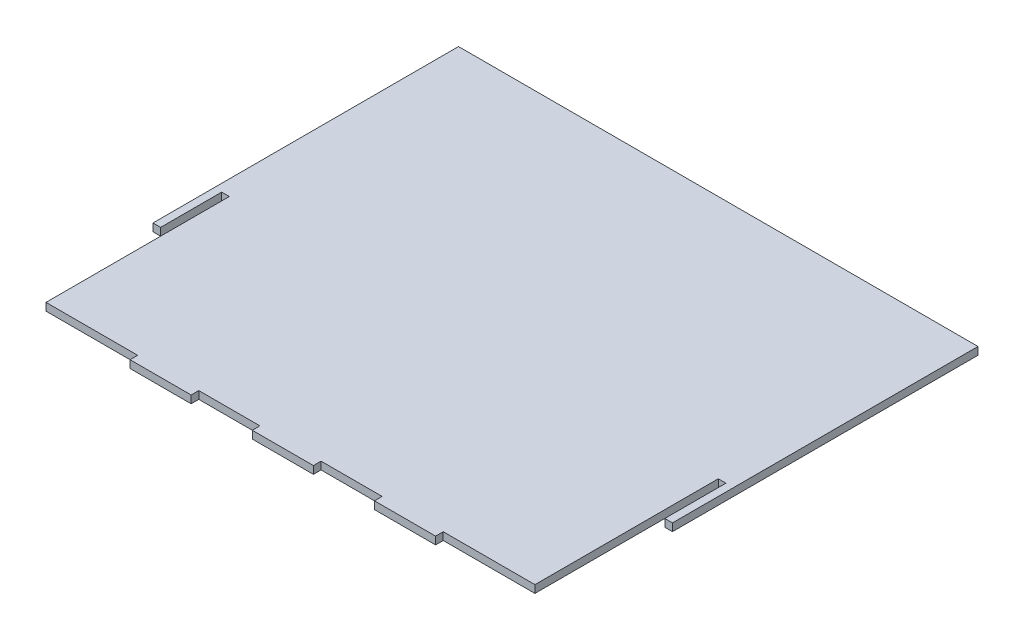
ISO-10303-21;
HEADER;
FILE_DESCRIPTION(('STEP AP214'),'2;1');
FILE_NAME('part.step','',(''),(''),'','','');
FILE_SCHEMA(('AUTOMOTIVE_DESIGN { 1 0 10303 214 1 1 1 1 }'));
ENDSEC;
DATA;
#1=APPLICATION_CONTEXT('core data for automotive mechanical design processes');
#2=APPLICATION_PROTOCOL_DEFINITION('international standard','automotive_design',2000,#1);
#3=PRODUCT_CONTEXT('',#1,'mechanical');
#4=PRODUCT('Part','Part','',(#3));
#5=PRODUCT_RELATED_PRODUCT_CATEGORY('part','',(#4));
#6=PRODUCT_DEFINITION_FORMATION('','',#4);
#7=PRODUCT_DEFINITION_CONTEXT('part definition',#1,'design');
#8=PRODUCT_DEFINITION('design','',#6,#7);
#9=PRODUCT_DEFINITION_SHAPE('','',#8);
#10=(LENGTH_UNIT() NAMED_UNIT(*) SI_UNIT(.MILLI.,.METRE.));
#11=(NAMED_UNIT(*) PLANE_ANGLE_UNIT() SI_UNIT($,.RADIAN.));
#12=(NAMED_UNIT(*) SI_UNIT($,.STERADIAN.) SOLID_ANGLE_UNIT());
#13=UNCERTAINTY_MEASURE_WITH_UNIT(LENGTH_MEASURE(1.E-05),#10,'distance_accuracy_value','');
#14=(GEOMETRIC_REPRESENTATION_CONTEXT(3) GLOBAL_UNCERTAINTY_ASSIGNED_CONTEXT((#13)) GLOBAL_UNIT_ASSIGNED_CONTEXT((#10,
#11,#12)) REPRESENTATION_CONTEXT('',''));
#15=CARTESIAN_POINT('',(0.,0.,0.));
#16=DIRECTION('',(0.,0.,1.));
#17=DIRECTION('',(1.,0.,0.));
#18=AXIS2_PLACEMENT_3D('',#15,#16,#17);
#19=CARTESIAN_POINT('',(0.,1.5875,38.1));
#20=DIRECTION('',(0.,0.,1.));
#21=DIRECTION('',(1.,0.,0.));
#22=AXIS2_PLACEMENT_3D('',#19,#20,#21);
#23=PLANE('',#22);
#24=DIRECTION('',(-1.,0.,0.));
#25=VECTOR('',#24,1.);
#26=CARTESIAN_POINT('',(0.,-1.5875,38.1));
#27=LINE('',#26,#25);
#28=CARTESIAN_POINT('',(-104.775,-1.5875,38.1));
#29=VERTEX_POINT('',#28);
#30=CARTESIAN_POINT('',(-107.95,-1.5875,38.1));
#31=VERTEX_POINT('',#30);
#32=EDGE_CURVE('E230',#29,#31,#27,.T.);
#33=ORIENTED_EDGE('',*,*,#32,.F.);
#34=DIRECTION('',(0.,-1.,0.));
#35=VECTOR('',#34,1.);
#36=CARTESIAN_POINT('',(-104.775,1.5875,38.1));
#37=LINE('',#36,#35);
#38=CARTESIAN_POINT('',(-104.775,1.5875,38.1));
#39=VERTEX_POINT('',#38);
#40=EDGE_CURVE('E11',#39,#29,#37,.T.);
#41=ORIENTED_EDGE('',*,*,#40,.F.);
#42=DIRECTION('',(-1.,0.,0.));
#43=VECTOR('',#42,1.);
#44=CARTESIAN_POINT('',(0.,1.5875,38.1));
#45=LINE('',#44,#43);
#46=CARTESIAN_POINT('',(-107.95,1.5875,38.1));
#47=VERTEX_POINT('',#46);
#48=EDGE_CURVE('E284',#39,#47,#45,.T.);
#49=ORIENTED_EDGE('',*,*,#48,.T.);
#50=DIRECTION('',(0.,-1.,0.));
#51=VECTOR('',#50,1.);
#52=CARTESIAN_POINT('',(-107.95,1.5875,38.1));
#53=LINE('',#52,#51);
#54=EDGE_CURVE('E57',#47,#31,#53,.T.);
#55=ORIENTED_EDGE('',*,*,#54,.T.);
#56=EDGE_LOOP('',(#33,#41,#49,#55));
#57=FACE_BOUND('',#56,.T.);
#58=ADVANCED_FACE('F41',(#57),#23,.T.);
#59=CARTESIAN_POINT('',(-104.775,1.5875,0.));
#60=DIRECTION('',(1.,0.,0.));
#61=DIRECTION('',(0.,0.,-1.));
#62=AXIS2_PLACEMENT_3D('',#59,#60,#61);
#63=PLANE('',#62);
#64=DIRECTION('',(0.,0.,1.));
#65=VECTOR('',#64,1.);
#66=CARTESIAN_POINT('',(-104.775,-1.5875,0.));
#67=LINE('',#66,#65);
#68=CARTESIAN_POINT('',(-104.775,-1.5875,12.7));
#69=VERTEX_POINT('',#68);
#70=EDGE_CURVE('E232',#69,#29,#67,.T.);
#71=ORIENTED_EDGE('',*,*,#70,.F.);
#72=DIRECTION('',(0.,-1.,0.));
#73=VECTOR('',#72,1.);
#74=CARTESIAN_POINT('',(-104.775,1.5875,12.7));
#75=LINE('',#74,#73);
#76=CARTESIAN_POINT('',(-104.775,1.5875,12.7));
#77=VERTEX_POINT('',#76);
#78=EDGE_CURVE('E49',#77,#69,#75,.T.);
#79=ORIENTED_EDGE('',*,*,#78,.F.);
#80=DIRECTION('',(0.,0.,1.));
#81=VECTOR('',#80,1.);
#82=CARTESIAN_POINT('',(-104.775,1.5875,0.));
#83=LINE('',#82,#81);
#84=EDGE_CURVE('E355',#77,#39,#83,.T.);
#85=ORIENTED_EDGE('',*,*,#84,.T.);
#86=ORIENTED_EDGE('',*,*,#40,.T.);
#87=EDGE_LOOP('',(#71,#79,#85,#86));
#88=FACE_BOUND('',#87,.T.);
#89=ADVANCED_FACE('F343',(#88),#63,.T.);
#90=CARTESIAN_POINT('',(0.,1.5875,12.7));
#91=DIRECTION('',(0.,0.,1.));
#92=DIRECTION('',(1.,0.,0.));
#93=AXIS2_PLACEMENT_3D('',#90,#91,#92);
#94=PLANE('',#93);
#95=DIRECTION('',(-1.,0.,0.));
#96=VECTOR('',#95,1.);
#97=CARTESIAN_POINT('',(0.,-1.5875,12.7));
#98=LINE('',#97,#96);
#99=CARTESIAN_POINT('',(-101.6,-1.5875,12.7));
#100=VERTEX_POINT('',#99);
#101=EDGE_CURVE('E235',#100,#69,#98,.T.);
#102=ORIENTED_EDGE('',*,*,#101,.F.);
#103=DIRECTION('',(0.,-1.,0.));
#104=VECTOR('',#103,1.);
#105=CARTESIAN_POINT('',(-101.6,1.5875,12.7));
#106=LINE('',#105,#104);
#107=CARTESIAN_POINT('',(-101.6,1.5875,12.7));
#108=VERTEX_POINT('',#107);
#109=EDGE_CURVE('E332',#108,#100,#106,.T.);
#110=ORIENTED_EDGE('',*,*,#109,.F.);
#111=DIRECTION('',(-1.,0.,0.));
#112=VECTOR('',#111,1.);
#113=CARTESIAN_POINT('',(0.,1.5875,12.7));
#114=LINE('',#113,#112);
#115=EDGE_CURVE('E339',#108,#77,#114,.T.);
#116=ORIENTED_EDGE('',*,*,#115,.T.);
#117=ORIENTED_EDGE('',*,*,#78,.T.);
#118=EDGE_LOOP('',(#102,#110,#116,#117));
#119=FACE_BOUND('',#118,.T.);
#120=ADVANCED_FACE('F337',(#119),#94,.T.);
#121=CARTESIAN_POINT('',(-101.6,1.5875,0.));
#122=DIRECTION('',(-1.,0.,0.));
#123=DIRECTION('',(0.,0.,1.));
#124=AXIS2_PLACEMENT_3D('',#121,#122,#123);
#125=PLANE('',#124);
#126=DIRECTION('',(0.,0.,-1.));
#127=VECTOR('',#126,1.);
#128=CARTESIAN_POINT('',(-101.6,-1.5875,0.));
#129=LINE('',#128,#127);
#130=CARTESIAN_POINT('',(-101.6,-1.5875,88.9));
#131=VERTEX_POINT('',#130);
#132=EDGE_CURVE('E238',#131,#100,#129,.T.);
#133=ORIENTED_EDGE('',*,*,#132,.F.);
#134=DIRECTION('',(0.,-1.,0.));
#135=VECTOR('',#134,1.);
#136=CARTESIAN_POINT('',(-101.6,1.5875,88.9));
#137=LINE('',#136,#135);
#138=CARTESIAN_POINT('',(-101.6,1.5875,88.9));
#139=VERTEX_POINT('',#138);
#140=EDGE_CURVE('E330',#139,#131,#137,.T.);
#141=ORIENTED_EDGE('',*,*,#140,.F.);
#142=DIRECTION('',(0.,0.,-1.));
#143=VECTOR('',#142,1.);
#144=CARTESIAN_POINT('',(-101.6,1.5875,0.));
#145=LINE('',#144,#143);
#146=EDGE_CURVE('E354',#139,#108,#145,.T.);
#147=ORIENTED_EDGE('',*,*,#146,.T.);
#148=ORIENTED_EDGE('',*,*,#109,.T.);
#149=EDGE_LOOP('',(#133,#141,#147,#148));
#150=FACE_BOUND('',#149,.T.);
#151=ADVANCED_FACE('F350',(#150),#125,.T.);
#152=CARTESIAN_POINT('',(0.,1.5875,88.9));
#153=DIRECTION('',(0.,0.,-1.));
#154=DIRECTION('',(-1.,0.,0.));
#155=AXIS2_PLACEMENT_3D('',#152,#153,#154);
#156=PLANE('',#155);
#157=DIRECTION('',(1.,0.,0.));
#158=VECTOR('',#157,1.);
#159=CARTESIAN_POINT('',(0.,-1.5875,88.9));
#160=LINE('',#159,#158);
#161=CARTESIAN_POINT('',(-63.5,-1.5875,88.9));
#162=VERTEX_POINT('',#161);
#163=EDGE_CURVE('E241',#131,#162,#160,.T.);
#164=ORIENTED_EDGE('',*,*,#163,.T.);
#165=DIRECTION('',(0.,-1.,0.));
#166=VECTOR('',#165,1.);
#167=CARTESIAN_POINT('',(-63.5,1.5875,88.9));
#168=LINE('',#167,#166);
#169=CARTESIAN_POINT('',(-63.5,1.5875,88.9));
#170=VERTEX_POINT('',#169);
#171=EDGE_CURVE('E327',#170,#162,#168,.T.);
#172=ORIENTED_EDGE('',*,*,#171,.F.);
#173=DIRECTION('',(1.,0.,0.));
#174=VECTOR('',#173,1.);
#175=CARTESIAN_POINT('',(0.,1.5875,88.9));
#176=LINE('',#175,#174);
#177=EDGE_CURVE('E357',#139,#170,#176,.T.);
#178=ORIENTED_EDGE('',*,*,#177,.F.);
#179=ORIENTED_EDGE('',*,*,#140,.T.);
#180=EDGE_LOOP('',(#164,#172,#178,#179));
#181=FACE_BOUND('',#180,.T.);
#182=ADVANCED_FACE('F423',(#181),#156,.F.);
#183=CARTESIAN_POINT('',(-63.5,1.5875,0.));
#184=DIRECTION('',(1.,0.,0.));
#185=DIRECTION('',(0.,0.,-1.));
#186=AXIS2_PLACEMENT_3D('',#183,#184,#185);
#187=PLANE('',#186);
#188=DIRECTION('',(0.,0.,1.));
#189=VECTOR('',#188,1.);
#190=CARTESIAN_POINT('',(-63.5,-1.5875,0.));
#191=LINE('',#190,#189);
#192=CARTESIAN_POINT('',(-63.5,-1.5875,92.075));
#193=VERTEX_POINT('',#192);
#194=EDGE_CURVE('E243',#162,#193,#191,.T.);
#195=ORIENTED_EDGE('',*,*,#194,.T.);
#196=DIRECTION('',(0.,-1.,0.));
#197=VECTOR('',#196,1.);
#198=CARTESIAN_POINT('',(-63.5,1.5875,92.075));
#199=LINE('',#198,#197);
#200=CARTESIAN_POINT('',(-63.5,1.5875,92.075));
#201=VERTEX_POINT('',#200);
#202=EDGE_CURVE('E324',#201,#193,#199,.T.);
#203=ORIENTED_EDGE('',*,*,#202,.F.);
#204=DIRECTION('',(0.,0.,1.));
#205=VECTOR('',#204,1.);
#206=CARTESIAN_POINT('',(-63.5,1.5875,0.));
#207=LINE('',#206,#205);
#208=EDGE_CURVE('E363',#170,#201,#207,.T.);
#209=ORIENTED_EDGE('',*,*,#208,.F.);
#210=ORIENTED_EDGE('',*,*,#171,.T.);
#211=EDGE_LOOP('',(#195,#203,#209,#210));
#212=FACE_BOUND('',#211,.T.);
#213=ADVANCED_FACE('F424',(#212),#187,.F.);
#214=CARTESIAN_POINT('',(0.,1.5875,92.075));
#215=DIRECTION('',(0.,0.,-1.));
#216=DIRECTION('',(-1.,0.,0.));
#217=AXIS2_PLACEMENT_3D('',#214,#215,#216);
#218=PLANE('',#217);
#219=DIRECTION('',(1.,0.,0.));
#220=VECTOR('',#219,1.);
#221=CARTESIAN_POINT('',(0.,-1.5875,92.075));
#222=LINE('',#221,#220);
#223=CARTESIAN_POINT('',(-38.1,-1.5875,92.075));
#224=VERTEX_POINT('',#223);
#225=EDGE_CURVE('E247',#193,#224,#222,.T.);
#226=ORIENTED_EDGE('',*,*,#225,.T.);
#227=DIRECTION('',(0.,-1.,0.));
#228=VECTOR('',#227,1.);
#229=CARTESIAN_POINT('',(-38.1,1.5875,92.075));
#230=LINE('',#229,#228);
#231=CARTESIAN_POINT('',(-38.1,1.5875,92.075));
#232=VERTEX_POINT('',#231);
#233=EDGE_CURVE('E322',#232,#224,#230,.T.);
#234=ORIENTED_EDGE('',*,*,#233,.F.);
#235=DIRECTION('',(1.,0.,0.));
#236=VECTOR('',#235,1.);
#237=CARTESIAN_POINT('',(0.,1.5875,92.075));
#238=LINE('',#237,#236);
#239=EDGE_CURVE('E367',#201,#232,#238,.T.);
#240=ORIENTED_EDGE('',*,*,#239,.F.);
#241=ORIENTED_EDGE('',*,*,#202,.T.);
#242=EDGE_LOOP('',(#226,#234,#240,#241));
#243=FACE_BOUND('',#242,.T.);
#244=ADVANCED_FACE('F427',(#243),#218,.F.);
#245=CARTESIAN_POINT('',(-38.1,1.5875,0.));
#246=DIRECTION('',(1.,0.,0.));
#247=DIRECTION('',(0.,0.,-1.));
#248=AXIS2_PLACEMENT_3D('',#245,#246,#247);
#249=PLANE('',#248);
#250=DIRECTION('',(0.,0.,1.));
#251=VECTOR('',#250,1.);
#252=CARTESIAN_POINT('',(-38.1,-1.5875,0.));
#253=LINE('',#252,#251);
#254=CARTESIAN_POINT('',(-38.1,-1.5875,88.9));
#255=VERTEX_POINT('',#254);
#256=EDGE_CURVE('E250',#255,#224,#253,.T.);
#257=ORIENTED_EDGE('',*,*,#256,.F.);
#258=DIRECTION('',(0.,-1.,0.));
#259=VECTOR('',#258,1.);
#260=CARTESIAN_POINT('',(-38.1,1.5875,88.9));
#261=LINE('',#260,#259);
#262=CARTESIAN_POINT('',(-38.1,1.5875,88.9));
#263=VERTEX_POINT('',#262);
#264=EDGE_CURVE('E320',#263,#255,#261,.T.);
#265=ORIENTED_EDGE('',*,*,#264,.F.);
#266=DIRECTION('',(0.,0.,1.));
#267=VECTOR('',#266,1.);
#268=CARTESIAN_POINT('',(-38.1,1.5875,0.));
#269=LINE('',#268,#267);
#270=EDGE_CURVE('E369',#263,#232,#269,.T.);
#271=ORIENTED_EDGE('',*,*,#270,.T.);
#272=ORIENTED_EDGE('',*,*,#233,.T.);
#273=EDGE_LOOP('',(#257,#265,#271,#272));
#274=FACE_BOUND('',#273,.T.);
#275=ADVANCED_FACE('F431',(#274),#249,.T.);
#276=CARTESIAN_POINT('',(-12.7,-1.5875,88.9));
#277=VERTEX_POINT('',#276);
#278=EDGE_CURVE('E245',#255,#277,#160,.T.);
#279=ORIENTED_EDGE('',*,*,#278,.T.);
#280=DIRECTION('',(0.,-1.,0.));
#281=VECTOR('',#280,1.);
#282=CARTESIAN_POINT('',(-12.7,1.5875,88.9));
#283=LINE('',#282,#281);
#284=CARTESIAN_POINT('',(-12.7,1.5875,88.9));
#285=VERTEX_POINT('',#284);
#286=EDGE_CURVE('E317',#285,#277,#283,.T.);
#287=ORIENTED_EDGE('',*,*,#286,.F.);
#288=EDGE_CURVE('E365',#263,#285,#176,.T.);
#289=ORIENTED_EDGE('',*,*,#288,.F.);
#290=ORIENTED_EDGE('',*,*,#264,.T.);
#291=EDGE_LOOP('',(#279,#287,#289,#290));
#292=FACE_BOUND('',#291,.T.);
#293=ADVANCED_FACE('F435',(#292),#156,.F.);
#294=CARTESIAN_POINT('',(-12.7,1.5875,0.));
#295=DIRECTION('',(1.,0.,0.));
#296=DIRECTION('',(0.,0.,-1.));
#297=AXIS2_PLACEMENT_3D('',#294,#295,#296);
#298=PLANE('',#297);
#299=DIRECTION('',(0.,0.,1.));
#300=VECTOR('',#299,1.);
#301=CARTESIAN_POINT('',(-12.7,-1.5875,0.));
#302=LINE('',#301,#300);
#303=CARTESIAN_POINT('',(-12.7,-1.5875,92.075));
#304=VERTEX_POINT('',#303);
#305=EDGE_CURVE('E253',#277,#304,#302,.T.);
#306=ORIENTED_EDGE('',*,*,#305,.T.);
#307=DIRECTION('',(0.,-1.,0.));
#308=VECTOR('',#307,1.);
#309=CARTESIAN_POINT('',(-12.7,1.5875,92.075));
#310=LINE('',#309,#308);
#311=CARTESIAN_POINT('',(-12.7,1.5875,92.075));
#312=VERTEX_POINT('',#311);
#313=EDGE_CURVE('E314',#312,#304,#310,.T.);
#314=ORIENTED_EDGE('',*,*,#313,.F.);
#315=DIRECTION('',(0.,0.,1.));
#316=VECTOR('',#315,1.);
#317=CARTESIAN_POINT('',(-12.7,1.5875,0.));
#318=LINE('',#317,#316);
#319=EDGE_CURVE('E372',#285,#312,#318,.T.);
#320=ORIENTED_EDGE('',*,*,#319,.F.);
#321=ORIENTED_EDGE('',*,*,#286,.T.);
#322=EDGE_LOOP('',(#306,#314,#320,#321));
#323=FACE_BOUND('',#322,.T.);
#324=ADVANCED_FACE('F437',(#323),#298,.F.);
#325=CARTESIAN_POINT('',(0.,1.5875,92.075));
#326=DIRECTION('',(0.,0.,-1.));
#327=DIRECTION('',(-1.,0.,0.));
#328=AXIS2_PLACEMENT_3D('',#325,#326,#327);
#329=PLANE('',#328);
#330=DIRECTION('',(1.,0.,0.));
#331=VECTOR('',#330,1.);
#332=CARTESIAN_POINT('',(0.,-1.5875,92.075));
#333=LINE('',#332,#331);
#334=CARTESIAN_POINT('',(12.7,-1.5875,92.075));
#335=VERTEX_POINT('',#334);
#336=EDGE_CURVE('E255',#304,#335,#333,.T.);
#337=ORIENTED_EDGE('',*,*,#336,.T.);
#338=DIRECTION('',(0.,-1.,0.));
#339=VECTOR('',#338,1.);
#340=CARTESIAN_POINT('',(12.7,1.5875,92.075));
#341=LINE('',#340,#339);
#342=CARTESIAN_POINT('',(12.7,1.5875,92.075));
#343=VERTEX_POINT('',#342);
#344=EDGE_CURVE('E312',#343,#335,#341,.T.);
#345=ORIENTED_EDGE('',*,*,#344,.F.);
#346=DIRECTION('',(1.,0.,0.));
#347=VECTOR('',#346,1.);
#348=CARTESIAN_POINT('',(0.,1.5875,92.075));
#349=LINE('',#348,#347);
#350=EDGE_CURVE('E374',#312,#343,#349,.T.);
#351=ORIENTED_EDGE('',*,*,#350,.F.);
#352=ORIENTED_EDGE('',*,*,#313,.T.);
#353=EDGE_LOOP('',(#337,#345,#351,#352));
#354=FACE_BOUND('',#353,.T.);
#355=ADVANCED_FACE('F440',(#354),#329,.F.);
#356=CARTESIAN_POINT('',(12.7000000000001,1.5875,0.));
#357=DIRECTION('',(1.,0.,0.));
#358=DIRECTION('',(0.,0.,-1.));
#359=AXIS2_PLACEMENT_3D('',#356,#357,#358);
#360=PLANE('',#359);
#361=DIRECTION('',(0.,0.,1.));
#362=VECTOR('',#361,1.);
#363=CARTESIAN_POINT('',(12.7000000000001,-1.5875,0.));
#364=LINE('',#363,#362);
#365=CARTESIAN_POINT('',(12.7,-1.5875,88.9));
#366=VERTEX_POINT('',#365);
#367=EDGE_CURVE('E258',#366,#335,#364,.T.);
#368=ORIENTED_EDGE('',*,*,#367,.F.);
#369=DIRECTION('',(0.,-1.,0.));
#370=VECTOR('',#369,1.);
#371=CARTESIAN_POINT('',(12.7,1.5875,88.9));
#372=LINE('',#371,#370);
#373=CARTESIAN_POINT('',(12.7,1.5875,88.9));
#374=VERTEX_POINT('',#373);
#375=EDGE_CURVE('E310',#374,#366,#372,.T.);
#376=ORIENTED_EDGE('',*,*,#375,.F.);
#377=DIRECTION('',(0.,0.,1.));
#378=VECTOR('',#377,1.);
#379=CARTESIAN_POINT('',(12.7000000000001,1.5875,0.));
#380=LINE('',#379,#378);
#381=EDGE_CURVE('E376',#374,#343,#380,.T.);
#382=ORIENTED_EDGE('',*,*,#381,.T.);
#383=ORIENTED_EDGE('',*,*,#344,.T.);
#384=EDGE_LOOP('',(#368,#376,#382,#383));
#385=FACE_BOUND('',#384,.T.);
#386=ADVANCED_FACE('F444',(#385),#360,.T.);
#387=CARTESIAN_POINT('',(38.1,-1.5875,88.9));
#388=VERTEX_POINT('',#387);
#389=EDGE_CURVE('E261',#366,#388,#160,.T.);
#390=ORIENTED_EDGE('',*,*,#389,.T.);
#391=DIRECTION('',(0.,-1.,0.));
#392=VECTOR('',#391,1.);
#393=CARTESIAN_POINT('',(38.1,1.5875,88.9));
#394=LINE('',#393,#392);
#395=CARTESIAN_POINT('',(38.1,1.5875,88.9));
#396=VERTEX_POINT('',#395);
#397=EDGE_CURVE('E307',#396,#388,#394,.T.);
#398=ORIENTED_EDGE('',*,*,#397,.F.);
#399=EDGE_CURVE('E379',#374,#396,#176,.T.);
#400=ORIENTED_EDGE('',*,*,#399,.F.);
#401=ORIENTED_EDGE('',*,*,#375,.T.);
#402=EDGE_LOOP('',(#390,#398,#400,#401));
#403=FACE_BOUND('',#402,.T.);
#404=ADVANCED_FACE('F448',(#403),#156,.F.);
#405=CARTESIAN_POINT('',(38.1,1.5875,0.));
#406=DIRECTION('',(1.,0.,0.));
#407=DIRECTION('',(0.,0.,-1.));
#408=AXIS2_PLACEMENT_3D('',#405,#406,#407);
#409=PLANE('',#408);
#410=DIRECTION('',(0.,0.,1.));
#411=VECTOR('',#410,1.);
#412=CARTESIAN_POINT('',(38.1,-1.5875,0.));
#413=LINE('',#412,#411);
#414=CARTESIAN_POINT('',(38.1,-1.5875,92.075));
#415=VERTEX_POINT('',#414);
#416=EDGE_CURVE('E262',#388,#415,#413,.T.);
#417=ORIENTED_EDGE('',*,*,#416,.T.);
#418=DIRECTION('',(0.,-1.,0.));
#419=VECTOR('',#418,1.);
#420=CARTESIAN_POINT('',(38.1,1.5875,92.075));
#421=LINE('',#420,#419);
#422=CARTESIAN_POINT('',(38.1,1.5875,92.075));
#423=VERTEX_POINT('',#422);
#424=EDGE_CURVE('E304',#423,#415,#421,.T.);
#425=ORIENTED_EDGE('',*,*,#424,.F.);
#426=DIRECTION('',(0.,0.,1.));
#427=VECTOR('',#426,1.);
#428=CARTESIAN_POINT('',(38.1,1.5875,0.));
#429=LINE('',#428,#427);
#430=EDGE_CURVE('E380',#396,#423,#429,.T.);
#431=ORIENTED_EDGE('',*,*,#430,.F.);
#432=ORIENTED_EDGE('',*,*,#397,.T.);
#433=EDGE_LOOP('',(#417,#425,#431,#432));
#434=FACE_BOUND('',#433,.T.);
#435=ADVANCED_FACE('F450',(#434),#409,.F.);
#436=CARTESIAN_POINT('',(0.,1.5875,92.075));
#437=DIRECTION('',(0.,0.,-1.));
#438=DIRECTION('',(-1.,0.,0.));
#439=AXIS2_PLACEMENT_3D('',#436,#437,#438);
#440=PLANE('',#439);
#441=DIRECTION('',(1.,0.,0.));
#442=VECTOR('',#441,1.);
#443=CARTESIAN_POINT('',(0.,-1.5875,92.075));
#444=LINE('',#443,#442);
#445=CARTESIAN_POINT('',(63.5,-1.5875,92.075));
#446=VERTEX_POINT('',#445);
#447=EDGE_CURVE('E264',#415,#446,#444,.T.);
#448=ORIENTED_EDGE('',*,*,#447,.T.);
#449=DIRECTION('',(0.,-1.,0.));
#450=VECTOR('',#449,1.);
#451=CARTESIAN_POINT('',(63.5,1.5875,92.075));
#452=LINE('',#451,#450);
#453=CARTESIAN_POINT('',(63.5,1.5875,92.075));
#454=VERTEX_POINT('',#453);
#455=EDGE_CURVE('E302',#454,#446,#452,.T.);
#456=ORIENTED_EDGE('',*,*,#455,.F.);
#457=DIRECTION('',(1.,0.,0.));
#458=VECTOR('',#457,1.);
#459=CARTESIAN_POINT('',(0.,1.5875,92.075));
#460=LINE('',#459,#458);
#461=EDGE_CURVE('E382',#423,#454,#460,.T.);
#462=ORIENTED_EDGE('',*,*,#461,.F.);
#463=ORIENTED_EDGE('',*,*,#424,.T.);
#464=EDGE_LOOP('',(#448,#456,#462,#463));
#465=FACE_BOUND('',#464,.T.);
#466=ADVANCED_FACE('F453',(#465),#440,.F.);
#467=CARTESIAN_POINT('',(63.5,1.5875,0.));
#468=DIRECTION('',(1.,0.,0.));
#469=DIRECTION('',(0.,0.,-1.));
#470=AXIS2_PLACEMENT_3D('',#467,#468,#469);
#471=PLANE('',#470);
#472=DIRECTION('',(0.,0.,1.));
#473=VECTOR('',#472,1.);
#474=CARTESIAN_POINT('',(63.5,-1.5875,0.));
#475=LINE('',#474,#473);
#476=CARTESIAN_POINT('',(63.5,-1.5875,88.9));
#477=VERTEX_POINT('',#476);
#478=EDGE_CURVE('E267',#477,#446,#475,.T.);
#479=ORIENTED_EDGE('',*,*,#478,.F.);
#480=DIRECTION('',(0.,-1.,0.));
#481=VECTOR('',#480,1.);
#482=CARTESIAN_POINT('',(63.5,1.5875,88.9));
#483=LINE('',#482,#481);
#484=CARTESIAN_POINT('',(63.5,1.5875,88.9));
#485=VERTEX_POINT('',#484);
#486=EDGE_CURVE('E300',#485,#477,#483,.T.);
#487=ORIENTED_EDGE('',*,*,#486,.F.);
#488=DIRECTION('',(0.,0.,1.));
#489=VECTOR('',#488,1.);
#490=CARTESIAN_POINT('',(63.5,1.5875,0.));
#491=LINE('',#490,#489);
#492=EDGE_CURVE('E384',#485,#454,#491,.T.);
#493=ORIENTED_EDGE('',*,*,#492,.T.);
#494=ORIENTED_EDGE('',*,*,#455,.T.);
#495=EDGE_LOOP('',(#479,#487,#493,#494));
#496=FACE_BOUND('',#495,.T.);
#497=ADVANCED_FACE('F457',(#496),#471,.T.);
#498=CARTESIAN_POINT('',(101.6,-1.5875,88.9));
#499=VERTEX_POINT('',#498);
#500=EDGE_CURVE('E244',#477,#499,#160,.T.);
#501=ORIENTED_EDGE('',*,*,#500,.T.);
#502=DIRECTION('',(0.,-1.,0.));
#503=VECTOR('',#502,1.);
#504=CARTESIAN_POINT('',(101.6,1.5875,88.9));
#505=LINE('',#504,#503);
#506=CARTESIAN_POINT('',(101.6,1.5875,88.9));
#507=VERTEX_POINT('',#506);
#508=EDGE_CURVE('E297',#507,#499,#505,.T.);
#509=ORIENTED_EDGE('',*,*,#508,.F.);
#510=EDGE_CURVE('E364',#485,#507,#176,.T.);
#511=ORIENTED_EDGE('',*,*,#510,.F.);
#512=ORIENTED_EDGE('',*,*,#486,.T.);
#513=EDGE_LOOP('',(#501,#509,#511,#512));
#514=FACE_BOUND('',#513,.T.);
#515=ADVANCED_FACE('F461',(#514),#156,.F.);
#516=CARTESIAN_POINT('',(101.6,1.5875,0.));
#517=DIRECTION('',(-1.,0.,0.));
#518=DIRECTION('',(0.,0.,1.));
#519=AXIS2_PLACEMENT_3D('',#516,#517,#518);
#520=PLANE('',#519);
#521=DIRECTION('',(0.,0.,-1.));
#522=VECTOR('',#521,1.);
#523=CARTESIAN_POINT('',(101.6,-1.5875,0.));
#524=LINE('',#523,#522);
#525=CARTESIAN_POINT('',(101.6,-1.5875,12.7));
#526=VERTEX_POINT('',#525);
#527=EDGE_CURVE('E270',#499,#526,#524,.T.);
#528=ORIENTED_EDGE('',*,*,#527,.T.);
#529=DIRECTION('',(0.,-1.,0.));
#530=VECTOR('',#529,1.);
#531=CARTESIAN_POINT('',(101.6,1.5875,12.7));
#532=LINE('',#531,#530);
#533=CARTESIAN_POINT('',(101.6,1.5875,12.7));
#534=VERTEX_POINT('',#533);
#535=EDGE_CURVE('E294',#534,#526,#532,.T.);
#536=ORIENTED_EDGE('',*,*,#535,.F.);
#537=DIRECTION('',(0.,0.,-1.));
#538=VECTOR('',#537,1.);
#539=CARTESIAN_POINT('',(101.6,1.5875,0.));
#540=LINE('',#539,#538);
#541=EDGE_CURVE('E387',#507,#534,#540,.T.);
#542=ORIENTED_EDGE('',*,*,#541,.F.);
#543=ORIENTED_EDGE('',*,*,#508,.T.);
#544=EDGE_LOOP('',(#528,#536,#542,#543));
#545=FACE_BOUND('',#544,.T.);
#546=ADVANCED_FACE('F465',(#545),#520,.F.);
#547=CARTESIAN_POINT('',(0.,1.5875,12.6999999999999));
#548=DIRECTION('',(0.,0.,-1.));
#549=DIRECTION('',(-1.,0.,0.));
#550=AXIS2_PLACEMENT_3D('',#547,#548,#549);
#551=PLANE('',#550);
#552=DIRECTION('',(1.,0.,0.));
#553=VECTOR('',#552,1.);
#554=CARTESIAN_POINT('',(0.,-1.5875,12.6999999999999));
#555=LINE('',#554,#553);
#556=CARTESIAN_POINT('',(104.775,-1.5875,12.7));
#557=VERTEX_POINT('',#556);
#558=EDGE_CURVE('E272',#526,#557,#555,.T.);
#559=ORIENTED_EDGE('',*,*,#558,.T.);
#560=DIRECTION('',(0.,-1.,0.));
#561=VECTOR('',#560,1.);
#562=CARTESIAN_POINT('',(104.775,1.5875,12.7));
#563=LINE('',#562,#561);
#564=CARTESIAN_POINT('',(104.775,1.5875,12.7));
#565=VERTEX_POINT('',#564);
#566=EDGE_CURVE('E291',#565,#557,#563,.T.);
#567=ORIENTED_EDGE('',*,*,#566,.F.);
#568=DIRECTION('',(1.,0.,0.));
#569=VECTOR('',#568,1.);
#570=CARTESIAN_POINT('',(0.,1.5875,12.6999999999999));
#571=LINE('',#570,#569);
#572=EDGE_CURVE('E389',#534,#565,#571,.T.);
#573=ORIENTED_EDGE('',*,*,#572,.F.);
#574=ORIENTED_EDGE('',*,*,#535,.T.);
#575=EDGE_LOOP('',(#559,#567,#573,#574));
#576=FACE_BOUND('',#575,.T.);
#577=ADVANCED_FACE('F469',(#576),#551,.F.);
#578=CARTESIAN_POINT('',(104.775,1.5875,0.));
#579=DIRECTION('',(1.,0.,0.));
#580=DIRECTION('',(0.,0.,-1.));
#581=AXIS2_PLACEMENT_3D('',#578,#579,#580);
#582=PLANE('',#581);
#583=DIRECTION('',(0.,0.,1.));
#584=VECTOR('',#583,1.);
#585=CARTESIAN_POINT('',(104.775,-1.5875,0.));
#586=LINE('',#585,#584);
#587=CARTESIAN_POINT('',(104.775,-1.5875,38.1));
#588=VERTEX_POINT('',#587);
#589=EDGE_CURVE('E274',#557,#588,#586,.T.);
#590=ORIENTED_EDGE('',*,*,#589,.T.);
#591=DIRECTION('',(0.,-1.,0.));
#592=VECTOR('',#591,1.);
#593=CARTESIAN_POINT('',(104.775,1.5875,38.1));
#594=LINE('',#593,#592);
#595=CARTESIAN_POINT('',(104.775,1.5875,38.1));
#596=VERTEX_POINT('',#595);
#597=EDGE_CURVE('E288',#596,#588,#594,.T.);
#598=ORIENTED_EDGE('',*,*,#597,.F.);
#599=DIRECTION('',(0.,0.,1.));
#600=VECTOR('',#599,1.);
#601=CARTESIAN_POINT('',(104.775,1.5875,0.));
#602=LINE('',#601,#600);
#603=EDGE_CURVE('E391',#565,#596,#602,.T.);
#604=ORIENTED_EDGE('',*,*,#603,.F.);
#605=ORIENTED_EDGE('',*,*,#566,.T.);
#606=EDGE_LOOP('',(#590,#598,#604,#605));
#607=FACE_BOUND('',#606,.T.);
#608=ADVANCED_FACE('F397',(#607),#582,.F.);
#609=CARTESIAN_POINT('',(0.,1.5875,38.0999999999997));
#610=DIRECTION('',(0.,0.,-1.));
#611=DIRECTION('',(-1.,0.,0.));
#612=AXIS2_PLACEMENT_3D('',#609,#610,#611);
#613=PLANE('',#612);
#614=DIRECTION('',(1.,0.,0.));
#615=VECTOR('',#614,1.);
#616=CARTESIAN_POINT('',(0.,-1.5875,38.0999999999997));
#617=LINE('',#616,#615);
#618=CARTESIAN_POINT('',(107.95,-1.5875,38.1));
#619=VERTEX_POINT('',#618);
#620=EDGE_CURVE('E276',#588,#619,#617,.T.);
#621=ORIENTED_EDGE('',*,*,#620,.T.);
#622=DIRECTION('',(0.,-1.,0.));
#623=VECTOR('',#622,1.);
#624=CARTESIAN_POINT('',(107.95,1.5875,38.1));
#625=LINE('',#624,#623);
#626=CARTESIAN_POINT('',(107.95,1.5875,38.1));
#627=VERTEX_POINT('',#626);
#628=EDGE_CURVE('E222',#627,#619,#625,.T.);
#629=ORIENTED_EDGE('',*,*,#628,.F.);
#630=DIRECTION('',(1.,0.,0.));
#631=VECTOR('',#630,1.);
#632=CARTESIAN_POINT('',(0.,1.5875,38.0999999999997));
#633=LINE('',#632,#631);
#634=EDGE_CURVE('E210',#596,#627,#633,.T.);
#635=ORIENTED_EDGE('',*,*,#634,.F.);
#636=ORIENTED_EDGE('',*,*,#597,.T.);
#637=EDGE_LOOP('',(#621,#629,#635,#636));
#638=FACE_BOUND('',#637,.T.);
#639=ADVANCED_FACE('F401',(#638),#613,.F.);
#640=CARTESIAN_POINT('',(107.95,1.5875,0.));
#641=DIRECTION('',(-1.,0.,0.));
#642=DIRECTION('',(0.,0.,1.));
#643=AXIS2_PLACEMENT_3D('',#640,#641,#642);
#644=PLANE('',#643);
#645=DIRECTION('',(0.,0.,-1.));
#646=VECTOR('',#645,1.);
#647=CARTESIAN_POINT('',(107.95,-1.5875,0.));
#648=LINE('',#647,#646);
#649=CARTESIAN_POINT('',(107.95,-1.5875,-88.9));
#650=VERTEX_POINT('',#649);
#651=EDGE_CURVE('E219',#619,#650,#648,.T.);
#652=ORIENTED_EDGE('',*,*,#651,.T.);
#653=DIRECTION('',(0.,-1.,0.));
#654=VECTOR('',#653,1.);
#655=CARTESIAN_POINT('',(107.95,1.5875,-88.9));
#656=LINE('',#655,#654);
#657=CARTESIAN_POINT('',(107.95,1.5875,-88.9));
#658=VERTEX_POINT('',#657);
#659=EDGE_CURVE('E216',#658,#650,#656,.T.);
#660=ORIENTED_EDGE('',*,*,#659,.F.);
#661=DIRECTION('',(0.,0.,-1.));
#662=VECTOR('',#661,1.);
#663=CARTESIAN_POINT('',(107.95,1.5875,0.));
#664=LINE('',#663,#662);
#665=EDGE_CURVE('E203',#627,#658,#664,.T.);
#666=ORIENTED_EDGE('',*,*,#665,.F.);
#667=ORIENTED_EDGE('',*,*,#628,.T.);
#668=EDGE_LOOP('',(#652,#660,#666,#667));
#669=FACE_BOUND('',#668,.T.);
#670=ADVANCED_FACE('F217',(#669),#644,.F.);
#671=CARTESIAN_POINT('',(0.,1.5875,-88.9));
#672=DIRECTION('',(0.,0.,-1.));
#673=DIRECTION('',(-1.,0.,0.));
#674=AXIS2_PLACEMENT_3D('',#671,#672,#673);
#675=PLANE('',#674);
#676=DIRECTION('',(1.,0.,0.));
#677=VECTOR('',#676,1.);
#678=CARTESIAN_POINT('',(0.,-1.5875,-88.9));
#679=LINE('',#678,#677);
#680=CARTESIAN_POINT('',(-107.95,-1.5875,-88.9));
#681=VERTEX_POINT('',#680);
#682=EDGE_CURVE('E279',#681,#650,#679,.T.);
#683=ORIENTED_EDGE('',*,*,#682,.F.);
#684=DIRECTION('',(0.,-1.,0.));
#685=VECTOR('',#684,1.);
#686=CARTESIAN_POINT('',(-107.95,1.5875,-88.9));
#687=LINE('',#686,#685);
#688=CARTESIAN_POINT('',(-107.95,1.5875,-88.9));
#689=VERTEX_POINT('',#688);
#690=EDGE_CURVE('E130',#689,#681,#687,.T.);
#691=ORIENTED_EDGE('',*,*,#690,.F.);
#692=DIRECTION('',(1.,0.,0.));
#693=VECTOR('',#692,1.);
#694=CARTESIAN_POINT('',(0.,1.5875,-88.9));
#695=LINE('',#694,#693);
#696=EDGE_CURVE('E208',#689,#658,#695,.T.);
#697=ORIENTED_EDGE('',*,*,#696,.T.);
#698=ORIENTED_EDGE('',*,*,#659,.T.);
#699=EDGE_LOOP('',(#683,#691,#697,#698));
#700=FACE_BOUND('',#699,.T.);
#701=ADVANCED_FACE('F224',(#700),#675,.T.);
#702=CARTESIAN_POINT('',(-107.95,1.5875,0.));
#703=DIRECTION('',(-1.,0.,0.));
#704=DIRECTION('',(0.,0.,1.));
#705=AXIS2_PLACEMENT_3D('',#702,#703,#704);
#706=PLANE('',#705);
#707=DIRECTION('',(0.,0.,-1.));
#708=VECTOR('',#707,1.);
#709=CARTESIAN_POINT('',(-107.95,-1.5875,0.));
#710=LINE('',#709,#708);
#711=EDGE_CURVE('E281',#31,#681,#710,.T.);
#712=ORIENTED_EDGE('',*,*,#711,.F.);
#713=ORIENTED_EDGE('',*,*,#54,.F.);
#714=DIRECTION('',(0.,0.,-1.));
#715=VECTOR('',#714,1.);
#716=CARTESIAN_POINT('',(-107.95,1.5875,0.));
#717=LINE('',#716,#715);
#718=EDGE_CURVE('E225',#47,#689,#717,.T.);
#719=ORIENTED_EDGE('',*,*,#718,.T.);
#720=ORIENTED_EDGE('',*,*,#690,.T.);
#721=EDGE_LOOP('',(#712,#713,#719,#720));
#722=FACE_BOUND('',#721,.T.);
#723=ADVANCED_FACE('F402',(#722),#706,.T.);
#724=CARTESIAN_POINT('',(0.,1.5875,0.));
#725=DIRECTION('',(0.,1.,0.));
#726=DIRECTION('',(0.,0.,1.));
#727=AXIS2_PLACEMENT_3D('',#724,#725,#726);
#728=PLANE('',#727);
#729=ORIENTED_EDGE('',*,*,#48,.F.);
#730=ORIENTED_EDGE('',*,*,#84,.F.);
#731=ORIENTED_EDGE('',*,*,#115,.F.);
#732=ORIENTED_EDGE('',*,*,#146,.F.);
#733=ORIENTED_EDGE('',*,*,#177,.T.);
#734=ORIENTED_EDGE('',*,*,#208,.T.);
#735=ORIENTED_EDGE('',*,*,#239,.T.);
#736=ORIENTED_EDGE('',*,*,#270,.F.);
#737=ORIENTED_EDGE('',*,*,#288,.T.);
#738=ORIENTED_EDGE('',*,*,#319,.T.);
#739=ORIENTED_EDGE('',*,*,#350,.T.);
#740=ORIENTED_EDGE('',*,*,#381,.F.);
#741=ORIENTED_EDGE('',*,*,#399,.T.);
#742=ORIENTED_EDGE('',*,*,#430,.T.);
#743=ORIENTED_EDGE('',*,*,#461,.T.);
#744=ORIENTED_EDGE('',*,*,#492,.F.);
#745=ORIENTED_EDGE('',*,*,#510,.T.);
#746=ORIENTED_EDGE('',*,*,#541,.T.);
#747=ORIENTED_EDGE('',*,*,#572,.T.);
#748=ORIENTED_EDGE('',*,*,#603,.T.);
#749=ORIENTED_EDGE('',*,*,#634,.T.);
#750=ORIENTED_EDGE('',*,*,#665,.T.);
#751=ORIENTED_EDGE('',*,*,#696,.F.);
#752=ORIENTED_EDGE('',*,*,#718,.F.);
#753=EDGE_LOOP('',(#729,#730,#731,#732,#733,#734,#735,#736,#737,#738,#739,#740,#741,#742,#743,
#744,#745,#746,#747,#748,#749,#750,#751,#752));
#754=FACE_BOUND('',#753,.T.);
#755=ADVANCED_FACE('F205',(#754),#728,.T.);
#756=CARTESIAN_POINT('',(0.,-1.5875,0.));
#757=DIRECTION('',(0.,1.,0.));
#758=DIRECTION('',(0.,0.,1.));
#759=AXIS2_PLACEMENT_3D('',#756,#757,#758);
#760=PLANE('',#759);
#761=ORIENTED_EDGE('',*,*,#32,.T.);
#762=ORIENTED_EDGE('',*,*,#711,.T.);
#763=ORIENTED_EDGE('',*,*,#682,.T.);
#764=ORIENTED_EDGE('',*,*,#651,.F.);
#765=ORIENTED_EDGE('',*,*,#620,.F.);
#766=ORIENTED_EDGE('',*,*,#589,.F.);
#767=ORIENTED_EDGE('',*,*,#558,.F.);
#768=ORIENTED_EDGE('',*,*,#527,.F.);
#769=ORIENTED_EDGE('',*,*,#500,.F.);
#770=ORIENTED_EDGE('',*,*,#478,.T.);
#771=ORIENTED_EDGE('',*,*,#447,.F.);
#772=ORIENTED_EDGE('',*,*,#416,.F.);
#773=ORIENTED_EDGE('',*,*,#389,.F.);
#774=ORIENTED_EDGE('',*,*,#367,.T.);
#775=ORIENTED_EDGE('',*,*,#336,.F.);
#776=ORIENTED_EDGE('',*,*,#305,.F.);
#777=ORIENTED_EDGE('',*,*,#278,.F.);
#778=ORIENTED_EDGE('',*,*,#256,.T.);
#779=ORIENTED_EDGE('',*,*,#225,.F.);
#780=ORIENTED_EDGE('',*,*,#194,.F.);
#781=ORIENTED_EDGE('',*,*,#163,.F.);
#782=ORIENTED_EDGE('',*,*,#132,.T.);
#783=ORIENTED_EDGE('',*,*,#101,.T.);
#784=ORIENTED_EDGE('',*,*,#70,.T.);
#785=EDGE_LOOP('',(#761,#762,#763,#764,#765,#766,#767,#768,#769,#770,#771,#772,#773,#774,#775,
#776,#777,#778,#779,#780,#781,#782,#783,#784));
#786=FACE_BOUND('',#785,.T.);
#787=ADVANCED_FACE('F345',(#786),#760,.F.);
#788=CLOSED_SHELL('',(#58,#89,#120,#151,#182,#213,#244,#275,#293,#324,#355,#386,#404,#435,#466,
#497,#515,#546,#577,#608,#639,#670,#701,#723,#755,#787));
#789=MANIFOLD_SOLID_BREP('B2',#788);
#790=ADVANCED_BREP_SHAPE_REPRESENTATION('',(#18,#789),#14);
#791=SHAPE_DEFINITION_REPRESENTATION(#9,#790);
ENDSEC;
END-ISO-10303-21;
